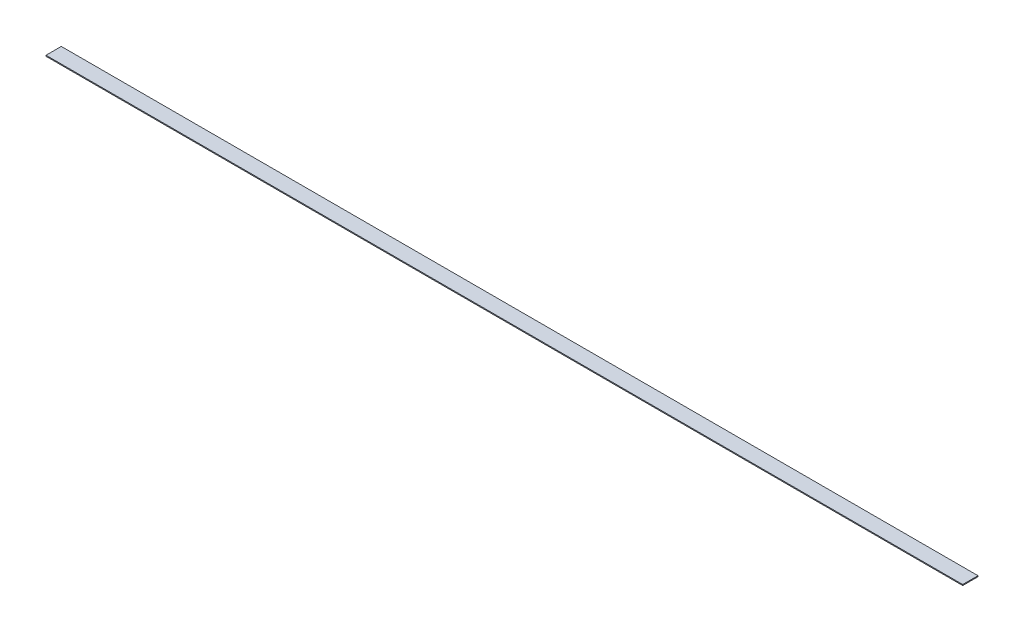
ISO-10303-21;
HEADER;
FILE_DESCRIPTION(('STEP AP214'),'2;1');
FILE_NAME('part.step','',(''),(''),'','','');
FILE_SCHEMA(('AUTOMOTIVE_DESIGN { 1 0 10303 214 1 1 1 1 }'));
ENDSEC;
DATA;
#1=APPLICATION_CONTEXT('core data for automotive mechanical design processes');
#2=APPLICATION_PROTOCOL_DEFINITION('international standard','automotive_design',2000,#1);
#3=PRODUCT_CONTEXT('',#1,'mechanical');
#4=PRODUCT('Part','Part','',(#3));
#5=PRODUCT_RELATED_PRODUCT_CATEGORY('part','',(#4));
#6=PRODUCT_DEFINITION_FORMATION('','',#4);
#7=PRODUCT_DEFINITION_CONTEXT('part definition',#1,'design');
#8=PRODUCT_DEFINITION('design','',#6,#7);
#9=PRODUCT_DEFINITION_SHAPE('','',#8);
#10=(LENGTH_UNIT() NAMED_UNIT(*) SI_UNIT(.MILLI.,.METRE.));
#11=(NAMED_UNIT(*) PLANE_ANGLE_UNIT() SI_UNIT($,.RADIAN.));
#12=(NAMED_UNIT(*) SI_UNIT($,.STERADIAN.) SOLID_ANGLE_UNIT());
#13=UNCERTAINTY_MEASURE_WITH_UNIT(LENGTH_MEASURE(1.E-05),#10,'distance_accuracy_value','');
#14=(GEOMETRIC_REPRESENTATION_CONTEXT(3) GLOBAL_UNCERTAINTY_ASSIGNED_CONTEXT((#13)) GLOBAL_UNIT_ASSIGNED_CONTEXT((#10,
#11,#12)) REPRESENTATION_CONTEXT('',''));
#15=CARTESIAN_POINT('',(0.,0.,0.));
#16=DIRECTION('',(0.,0.,1.));
#17=DIRECTION('',(1.,0.,0.));
#18=AXIS2_PLACEMENT_3D('',#15,#16,#17);
#19=CARTESIAN_POINT('',(0.,1.5875,0.));
#20=DIRECTION('',(1.,0.,0.));
#21=DIRECTION('',(0.,0.,-1.));
#22=AXIS2_PLACEMENT_3D('',#19,#20,#21);
#23=PLANE('',#22);
#24=DIRECTION('',(0.,0.,1.));
#25=VECTOR('',#24,1.);
#26=CARTESIAN_POINT('',(0.,0.,0.));
#27=LINE('',#26,#25);
#28=CARTESIAN_POINT('',(0.,0.,-25.4));
#29=VERTEX_POINT('',#28);
#30=CARTESIAN_POINT('',(0.,0.,0.));
#31=VERTEX_POINT('',#30);
#32=EDGE_CURVE('E98',#29,#31,#27,.T.);
#33=ORIENTED_EDGE('',*,*,#32,.T.);
#34=DIRECTION('',(0.,-1.,0.));
#35=VECTOR('',#34,1.);
#36=CARTESIAN_POINT('',(0.,1.5875,0.));
#37=LINE('',#36,#35);
#38=CARTESIAN_POINT('',(0.,1.5875,0.));
#39=VERTEX_POINT('',#38);
#40=EDGE_CURVE('E11',#39,#31,#37,.T.);
#41=ORIENTED_EDGE('',*,*,#40,.F.);
#42=DIRECTION('',(0.,0.,1.));
#43=VECTOR('',#42,1.);
#44=CARTESIAN_POINT('',(0.,1.5875,0.));
#45=LINE('',#44,#43);
#46=CARTESIAN_POINT('',(0.,1.5875,-25.4));
#47=VERTEX_POINT('',#46);
#48=EDGE_CURVE('E86',#47,#39,#45,.T.);
#49=ORIENTED_EDGE('',*,*,#48,.F.);
#50=DIRECTION('',(0.,-1.,0.));
#51=VECTOR('',#50,1.);
#52=CARTESIAN_POINT('',(0.,1.5875,-25.4));
#53=LINE('',#52,#51);
#54=EDGE_CURVE('E94',#47,#29,#53,.T.);
#55=ORIENTED_EDGE('',*,*,#54,.T.);
#56=EDGE_LOOP('',(#33,#41,#49,#55));
#57=FACE_BOUND('',#56,.T.);
#58=ADVANCED_FACE('F35',(#57),#23,.F.);
#59=CARTESIAN_POINT('',(0.,1.5875,0.));
#60=DIRECTION('',(0.,0.,-1.));
#61=DIRECTION('',(-1.,0.,0.));
#62=AXIS2_PLACEMENT_3D('',#59,#60,#61);
#63=PLANE('',#62);
#64=DIRECTION('',(1.,0.,0.));
#65=VECTOR('',#64,1.);
#66=CARTESIAN_POINT('',(0.,0.,0.));
#67=LINE('',#66,#65);
#68=CARTESIAN_POINT('',(1524.,0.,0.));
#69=VERTEX_POINT('',#68);
#70=EDGE_CURVE('E90',#31,#69,#67,.T.);
#71=ORIENTED_EDGE('',*,*,#70,.T.);
#72=DIRECTION('',(0.,-1.,0.));
#73=VECTOR('',#72,1.);
#74=CARTESIAN_POINT('',(1524.,1.5875,0.));
#75=LINE('',#74,#73);
#76=CARTESIAN_POINT('',(1524.,1.5875,0.));
#77=VERTEX_POINT('',#76);
#78=EDGE_CURVE('E43',#77,#69,#75,.T.);
#79=ORIENTED_EDGE('',*,*,#78,.F.);
#80=DIRECTION('',(1.,0.,0.));
#81=VECTOR('',#80,1.);
#82=CARTESIAN_POINT('',(0.,1.5875,0.));
#83=LINE('',#82,#81);
#84=EDGE_CURVE('E81',#39,#77,#83,.T.);
#85=ORIENTED_EDGE('',*,*,#84,.F.);
#86=ORIENTED_EDGE('',*,*,#40,.T.);
#87=EDGE_LOOP('',(#71,#79,#85,#86));
#88=FACE_BOUND('',#87,.T.);
#89=ADVANCED_FACE('F89',(#88),#63,.F.);
#90=CARTESIAN_POINT('',(1524.,1.5875,0.));
#91=DIRECTION('',(-1.,0.,0.));
#92=DIRECTION('',(0.,0.,1.));
#93=AXIS2_PLACEMENT_3D('',#90,#91,#92);
#94=PLANE('',#93);
#95=DIRECTION('',(0.,0.,-1.));
#96=VECTOR('',#95,1.);
#97=CARTESIAN_POINT('',(1524.,0.,0.));
#98=LINE('',#97,#96);
#99=CARTESIAN_POINT('',(1524.,0.,-25.4));
#100=VERTEX_POINT('',#99);
#101=EDGE_CURVE('E68',#69,#100,#98,.T.);
#102=ORIENTED_EDGE('',*,*,#101,.T.);
#103=DIRECTION('',(0.,-1.,0.));
#104=VECTOR('',#103,1.);
#105=CARTESIAN_POINT('',(1524.,1.5875,-25.4));
#106=LINE('',#105,#104);
#107=CARTESIAN_POINT('',(1524.,1.5875,-25.4));
#108=VERTEX_POINT('',#107);
#109=EDGE_CURVE('E91',#108,#100,#106,.T.);
#110=ORIENTED_EDGE('',*,*,#109,.F.);
#111=DIRECTION('',(0.,0.,-1.));
#112=VECTOR('',#111,1.);
#113=CARTESIAN_POINT('',(1524.,1.5875,0.));
#114=LINE('',#113,#112);
#115=EDGE_CURVE('E84',#77,#108,#114,.T.);
#116=ORIENTED_EDGE('',*,*,#115,.F.);
#117=ORIENTED_EDGE('',*,*,#78,.T.);
#118=EDGE_LOOP('',(#102,#110,#116,#117));
#119=FACE_BOUND('',#118,.T.);
#120=ADVANCED_FACE('F92',(#119),#94,.F.);
#121=CARTESIAN_POINT('',(0.,1.5875,-25.4));
#122=DIRECTION('',(0.,0.,1.));
#123=DIRECTION('',(1.,0.,0.));
#124=AXIS2_PLACEMENT_3D('',#121,#122,#123);
#125=PLANE('',#124);
#126=DIRECTION('',(-1.,0.,0.));
#127=VECTOR('',#126,1.);
#128=CARTESIAN_POINT('',(0.,0.,-25.4));
#129=LINE('',#128,#127);
#130=EDGE_CURVE('E74',#100,#29,#129,.T.);
#131=ORIENTED_EDGE('',*,*,#130,.T.);
#132=ORIENTED_EDGE('',*,*,#54,.F.);
#133=DIRECTION('',(-1.,0.,0.));
#134=VECTOR('',#133,1.);
#135=CARTESIAN_POINT('',(0.,1.5875,-25.4));
#136=LINE('',#135,#134);
#137=EDGE_CURVE('E51',#108,#47,#136,.T.);
#138=ORIENTED_EDGE('',*,*,#137,.F.);
#139=ORIENTED_EDGE('',*,*,#109,.T.);
#140=EDGE_LOOP('',(#131,#132,#138,#139));
#141=FACE_BOUND('',#140,.T.);
#142=ADVANCED_FACE('F105',(#141),#125,.F.);
#143=CARTESIAN_POINT('',(0.,1.5875,0.));
#144=DIRECTION('',(0.,-1.,0.));
#145=DIRECTION('',(0.,0.,-1.));
#146=AXIS2_PLACEMENT_3D('',#143,#144,#145);
#147=PLANE('',#146);
#148=ORIENTED_EDGE('',*,*,#48,.T.);
#149=ORIENTED_EDGE('',*,*,#84,.T.);
#150=ORIENTED_EDGE('',*,*,#115,.T.);
#151=ORIENTED_EDGE('',*,*,#137,.T.);
#152=EDGE_LOOP('',(#148,#149,#150,#151));
#153=FACE_BOUND('',#152,.T.);
#154=ADVANCED_FACE('F82',(#153),#147,.F.);
#155=CARTESIAN_POINT('',(0.,0.,0.));
#156=DIRECTION('',(0.,-1.,0.));
#157=DIRECTION('',(0.,0.,-1.));
#158=AXIS2_PLACEMENT_3D('',#155,#156,#157);
#159=PLANE('',#158);
#160=ORIENTED_EDGE('',*,*,#32,.F.);
#161=ORIENTED_EDGE('',*,*,#130,.F.);
#162=ORIENTED_EDGE('',*,*,#101,.F.);
#163=ORIENTED_EDGE('',*,*,#70,.F.);
#164=EDGE_LOOP('',(#160,#161,#162,#163));
#165=FACE_BOUND('',#164,.T.);
#166=ADVANCED_FACE('F108',(#165),#159,.T.);
#167=CLOSED_SHELL('',(#58,#89,#120,#142,#154,#166));
#168=MANIFOLD_SOLID_BREP('B2',#167);
#169=ADVANCED_BREP_SHAPE_REPRESENTATION('',(#18,#168),#14);
#170=SHAPE_DEFINITION_REPRESENTATION(#9,#169);
ENDSEC;
END-ISO-10303-21;
